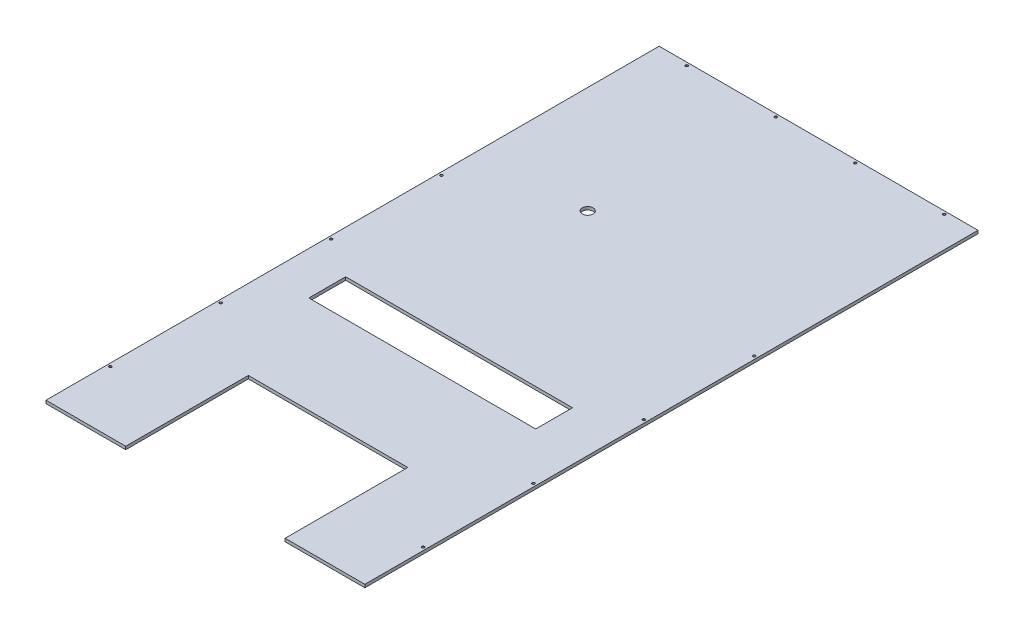
ISO-10303-21;
HEADER;
FILE_DESCRIPTION(('STEP AP214'),'2;1');
FILE_NAME('part.step','',(''),(''),'','','');
FILE_SCHEMA(('AUTOMOTIVE_DESIGN { 1 0 10303 214 1 1 1 1 }'));
ENDSEC;
DATA;
#1=APPLICATION_CONTEXT('core data for automotive mechanical design processes');
#2=APPLICATION_PROTOCOL_DEFINITION('international standard','automotive_design',2000,#1);
#3=PRODUCT_CONTEXT('',#1,'mechanical');
#4=PRODUCT('Part','Part','',(#3));
#5=PRODUCT_RELATED_PRODUCT_CATEGORY('part','',(#4));
#6=PRODUCT_DEFINITION_FORMATION('','',#4);
#7=PRODUCT_DEFINITION_CONTEXT('part definition',#1,'design');
#8=PRODUCT_DEFINITION('design','',#6,#7);
#9=PRODUCT_DEFINITION_SHAPE('','',#8);
#10=(LENGTH_UNIT() NAMED_UNIT(*) SI_UNIT(.MILLI.,.METRE.));
#11=(NAMED_UNIT(*) PLANE_ANGLE_UNIT() SI_UNIT($,.RADIAN.));
#12=(NAMED_UNIT(*) SI_UNIT($,.STERADIAN.) SOLID_ANGLE_UNIT());
#13=UNCERTAINTY_MEASURE_WITH_UNIT(LENGTH_MEASURE(1.E-05),#10,'distance_accuracy_value','');
#14=(GEOMETRIC_REPRESENTATION_CONTEXT(3) GLOBAL_UNCERTAINTY_ASSIGNED_CONTEXT((#13)) GLOBAL_UNIT_ASSIGNED_CONTEXT((#10,
#11,#12)) REPRESENTATION_CONTEXT('',''));
#15=CARTESIAN_POINT('',(0.,0.,0.));
#16=DIRECTION('',(0.,0.,1.));
#17=DIRECTION('',(1.,0.,0.));
#18=AXIS2_PLACEMENT_3D('',#15,#16,#17);
#19=CARTESIAN_POINT('',(0.,0.,2540.));
#20=DIRECTION('',(0.,1.,0.));
#21=DIRECTION('',(0.,0.,1.));
#22=AXIS2_PLACEMENT_3D('',#19,#20,#21);
#23=PLANE('',#22);
#24=CARTESIAN_POINT('',(442.977848989642,0.,738.973935122104));
#25=DIRECTION('',(0.,1.,0.));
#26=DIRECTION('',(0.,0.,1.));
#27=AXIS2_PLACEMENT_3D('',#24,#25,#26);
#28=CIRCLE('',#27,22.225);
#29=CARTESIAN_POINT('',(442.977848989642,0.,761.198935122104));
#30=VERTEX_POINT('',#29);
#31=EDGE_CURVE('E150',#30,#30,#28,.T.);
#32=ORIENTED_EDGE('',*,*,#31,.T.);
#33=EDGE_LOOP('',(#32));
#34=FACE_BOUND('',#33,.T.);
#35=DIRECTION('',(-1.,0.,0.));
#36=VECTOR('',#35,1.);
#37=CARTESIAN_POINT('',(177.8,0.,1476.502));
#38=LINE('',#37,#36);
#39=CARTESIAN_POINT('',(1117.6,0.,1476.502));
#40=VERTEX_POINT('',#39);
#41=CARTESIAN_POINT('',(177.8,0.,1476.502));
#42=VERTEX_POINT('',#41);
#43=EDGE_CURVE('E141',#40,#42,#38,.T.);
#44=ORIENTED_EDGE('',*,*,#43,.T.);
#45=DIRECTION('',(0.,0.,1.));
#46=VECTOR('',#45,1.);
#47=CARTESIAN_POINT('',(177.8,0.,1628.902));
#48=LINE('',#47,#46);
#49=CARTESIAN_POINT('',(177.8,0.,1628.902));
#50=VERTEX_POINT('',#49);
#51=EDGE_CURVE('E137',#42,#50,#48,.T.);
#52=ORIENTED_EDGE('',*,*,#51,.T.);
#53=DIRECTION('',(1.,0.,0.));
#54=VECTOR('',#53,1.);
#55=CARTESIAN_POINT('',(177.8,0.,1628.902));
#56=LINE('',#55,#54);
#57=CARTESIAN_POINT('',(1117.6,0.,1628.902));
#58=VERTEX_POINT('',#57);
#59=EDGE_CURVE('E144',#50,#58,#56,.T.);
#60=ORIENTED_EDGE('',*,*,#59,.T.);
#61=DIRECTION('',(0.,0.,-1.));
#62=VECTOR('',#61,1.);
#63=CARTESIAN_POINT('',(1117.6,0.,1628.902));
#64=LINE('',#63,#62);
#65=EDGE_CURVE('E60',#58,#40,#64,.T.);
#66=ORIENTED_EDGE('',*,*,#65,.T.);
#67=EDGE_LOOP('',(#44,#52,#60,#66));
#68=FACE_BOUND('',#67,.T.);
#69=CARTESIAN_POINT('',(1308.1,0.,2286.));
#70=DIRECTION('',(0.,1.,0.));
#71=DIRECTION('',(0.,0.,1.));
#72=AXIS2_PLACEMENT_3D('',#69,#70,#71);
#73=CIRCLE('',#72,4.7625);
#74=CARTESIAN_POINT('',(1308.1,0.,2290.7625));
#75=VERTEX_POINT('',#74);
#76=EDGE_CURVE('E171',#75,#75,#73,.T.);
#77=ORIENTED_EDGE('',*,*,#76,.T.);
#78=EDGE_LOOP('',(#77));
#79=FACE_BOUND('',#78,.T.);
#80=CARTESIAN_POINT('',(1308.1,0.,1828.8));
#81=DIRECTION('',(0.,1.,0.));
#82=DIRECTION('',(0.,0.,1.));
#83=AXIS2_PLACEMENT_3D('',#80,#81,#82);
#84=CIRCLE('',#83,4.7625);
#85=CARTESIAN_POINT('',(1308.1,0.,1833.5625));
#86=VERTEX_POINT('',#85);
#87=EDGE_CURVE('E180',#86,#86,#84,.T.);
#88=ORIENTED_EDGE('',*,*,#87,.T.);
#89=EDGE_LOOP('',(#88));
#90=FACE_BOUND('',#89,.T.);
#91=CARTESIAN_POINT('',(1308.1,0.,1371.6));
#92=DIRECTION('',(0.,1.,0.));
#93=DIRECTION('',(0.,0.,1.));
#94=AXIS2_PLACEMENT_3D('',#91,#92,#93);
#95=CIRCLE('',#94,4.7625);
#96=CARTESIAN_POINT('',(1308.1,0.,1376.3625));
#97=VERTEX_POINT('',#96);
#98=EDGE_CURVE('E189',#97,#97,#95,.T.);
#99=ORIENTED_EDGE('',*,*,#98,.T.);
#100=EDGE_LOOP('',(#99));
#101=FACE_BOUND('',#100,.T.);
#102=CARTESIAN_POINT('',(1308.1,0.,914.4));
#103=DIRECTION('',(0.,1.,0.));
#104=DIRECTION('',(0.,0.,1.));
#105=AXIS2_PLACEMENT_3D('',#102,#103,#104);
#106=CIRCLE('',#105,4.7625);
#107=CARTESIAN_POINT('',(1308.1,0.,919.1625));
#108=VERTEX_POINT('',#107);
#109=EDGE_CURVE('E198',#108,#108,#106,.T.);
#110=ORIENTED_EDGE('',*,*,#109,.T.);
#111=EDGE_LOOP('',(#110));
#112=FACE_BOUND('',#111,.T.);
#113=CARTESIAN_POINT('',(12.7000000000006,0.,2286.));
#114=DIRECTION('',(0.,1.,0.));
#115=DIRECTION('',(0.,0.,1.));
#116=AXIS2_PLACEMENT_3D('',#113,#114,#115);
#117=CIRCLE('',#116,4.7625);
#118=CARTESIAN_POINT('',(12.7000000000006,0.,2290.7625));
#119=VERTEX_POINT('',#118);
#120=EDGE_CURVE('E207',#119,#119,#117,.T.);
#121=ORIENTED_EDGE('',*,*,#120,.T.);
#122=EDGE_LOOP('',(#121));
#123=FACE_BOUND('',#122,.T.);
#124=CARTESIAN_POINT('',(12.7000000000004,0.,1828.8));
#125=DIRECTION('',(0.,1.,0.));
#126=DIRECTION('',(0.,0.,1.));
#127=AXIS2_PLACEMENT_3D('',#124,#125,#126);
#128=CIRCLE('',#127,4.7625);
#129=CARTESIAN_POINT('',(12.7000000000004,0.,1833.5625));
#130=VERTEX_POINT('',#129);
#131=EDGE_CURVE('E216',#130,#130,#128,.T.);
#132=ORIENTED_EDGE('',*,*,#131,.T.);
#133=EDGE_LOOP('',(#132));
#134=FACE_BOUND('',#133,.T.);
#135=CARTESIAN_POINT('',(12.7000000000004,0.,1371.6));
#136=DIRECTION('',(0.,1.,0.));
#137=DIRECTION('',(0.,0.,1.));
#138=AXIS2_PLACEMENT_3D('',#135,#136,#137);
#139=CIRCLE('',#138,4.7625);
#140=CARTESIAN_POINT('',(12.7000000000004,0.,1376.3625));
#141=VERTEX_POINT('',#140);
#142=EDGE_CURVE('E225',#141,#141,#139,.T.);
#143=ORIENTED_EDGE('',*,*,#142,.T.);
#144=EDGE_LOOP('',(#143));
#145=FACE_BOUND('',#144,.T.);
#146=CARTESIAN_POINT('',(12.7000000000002,0.,914.4));
#147=DIRECTION('',(0.,1.,0.));
#148=DIRECTION('',(0.,0.,1.));
#149=AXIS2_PLACEMENT_3D('',#146,#147,#148);
#150=CIRCLE('',#149,4.7625);
#151=CARTESIAN_POINT('',(12.7000000000002,0.,919.1625));
#152=VERTEX_POINT('',#151);
#153=EDGE_CURVE('E234',#152,#152,#150,.T.);
#154=ORIENTED_EDGE('',*,*,#153,.T.);
#155=EDGE_LOOP('',(#154));
#156=FACE_BOUND('',#155,.T.);
#157=CARTESIAN_POINT('',(495.3,0.,12.7000000000002));
#158=DIRECTION('',(0.,1.,0.));
#159=DIRECTION('',(0.,0.,1.));
#160=AXIS2_PLACEMENT_3D('',#157,#158,#159);
#161=CIRCLE('',#160,4.7625);
#162=CARTESIAN_POINT('',(495.3,0.,17.4625000000002));
#163=VERTEX_POINT('',#162);
#164=EDGE_CURVE('E243',#163,#163,#161,.T.);
#165=ORIENTED_EDGE('',*,*,#164,.T.);
#166=EDGE_LOOP('',(#165));
#167=FACE_BOUND('',#166,.T.);
#168=CARTESIAN_POINT('',(127.,0.,12.7000000000002));
#169=DIRECTION('',(0.,1.,0.));
#170=DIRECTION('',(0.,0.,1.));
#171=AXIS2_PLACEMENT_3D('',#168,#169,#170);
#172=CIRCLE('',#171,4.7625);
#173=CARTESIAN_POINT('',(127.,0.,17.4625000000002));
#174=VERTEX_POINT('',#173);
#175=EDGE_CURVE('E252',#174,#174,#172,.T.);
#176=ORIENTED_EDGE('',*,*,#175,.T.);
#177=EDGE_LOOP('',(#176));
#178=FACE_BOUND('',#177,.T.);
#179=CARTESIAN_POINT('',(1193.8,0.,12.7000000000001));
#180=DIRECTION('',(0.,1.,0.));
#181=DIRECTION('',(0.,0.,1.));
#182=AXIS2_PLACEMENT_3D('',#179,#180,#181);
#183=CIRCLE('',#182,4.7625);
#184=CARTESIAN_POINT('',(1193.8,0.,17.4625000000001));
#185=VERTEX_POINT('',#184);
#186=EDGE_CURVE('E261',#185,#185,#183,.T.);
#187=ORIENTED_EDGE('',*,*,#186,.T.);
#188=EDGE_LOOP('',(#187));
#189=FACE_BOUND('',#188,.T.);
#190=CARTESIAN_POINT('',(825.5,0.,12.7000000000002));
#191=DIRECTION('',(0.,1.,0.));
#192=DIRECTION('',(0.,0.,1.));
#193=AXIS2_PLACEMENT_3D('',#190,#191,#192);
#194=CIRCLE('',#193,4.7625);
#195=CARTESIAN_POINT('',(825.5,0.,17.4625000000002));
#196=VERTEX_POINT('',#195);
#197=EDGE_CURVE('E270',#196,#196,#194,.T.);
#198=ORIENTED_EDGE('',*,*,#197,.T.);
#199=EDGE_LOOP('',(#198));
#200=FACE_BOUND('',#199,.T.);
#201=DIRECTION('',(0.,0.,-1.));
#202=VECTOR('',#201,1.);
#203=CARTESIAN_POINT('',(330.2,0.,2540.));
#204=LINE('',#203,#202);
#205=CARTESIAN_POINT('',(330.2,0.,2540.));
#206=VERTEX_POINT('',#205);
#207=CARTESIAN_POINT('',(330.2,0.,2032.));
#208=VERTEX_POINT('',#207);
#209=EDGE_CURVE('E274',#206,#208,#204,.T.);
#210=ORIENTED_EDGE('',*,*,#209,.F.);
#211=DIRECTION('',(1.,0.,0.));
#212=VECTOR('',#211,1.);
#213=CARTESIAN_POINT('',(0.,0.,2540.));
#214=LINE('',#213,#212);
#215=CARTESIAN_POINT('',(0.,0.,2540.));
#216=VERTEX_POINT('',#215);
#217=EDGE_CURVE('E304',#216,#206,#214,.T.);
#218=ORIENTED_EDGE('',*,*,#217,.F.);
#219=DIRECTION('',(0.,0.,-1.));
#220=VECTOR('',#219,1.);
#221=CARTESIAN_POINT('',(0.,0.,2540.));
#222=LINE('',#221,#220);
#223=CARTESIAN_POINT('',(0.,0.,0.));
#224=VERTEX_POINT('',#223);
#225=EDGE_CURVE('E329',#216,#224,#222,.T.);
#226=ORIENTED_EDGE('',*,*,#225,.T.);
#227=DIRECTION('',(1.,0.,0.));
#228=VECTOR('',#227,1.);
#229=CARTESIAN_POINT('',(0.,0.,0.));
#230=LINE('',#229,#228);
#231=CARTESIAN_POINT('',(1320.8,0.,0.));
#232=VERTEX_POINT('',#231);
#233=EDGE_CURVE('E316',#224,#232,#230,.T.);
#234=ORIENTED_EDGE('',*,*,#233,.T.);
#235=DIRECTION('',(0.,0.,-1.));
#236=VECTOR('',#235,1.);
#237=CARTESIAN_POINT('',(1320.8,0.,2540.));
#238=LINE('',#237,#236);
#239=CARTESIAN_POINT('',(1320.8,0.,2540.));
#240=VERTEX_POINT('',#239);
#241=EDGE_CURVE('E326',#240,#232,#238,.T.);
#242=ORIENTED_EDGE('',*,*,#241,.F.);
#243=CARTESIAN_POINT('',(990.6,0.,2540.));
#244=VERTEX_POINT('',#243);
#245=EDGE_CURVE('E302',#244,#240,#214,.T.);
#246=ORIENTED_EDGE('',*,*,#245,.F.);
#247=DIRECTION('',(0.,0.,1.));
#248=VECTOR('',#247,1.);
#249=CARTESIAN_POINT('',(990.6,0.,2032.));
#250=LINE('',#249,#248);
#251=CARTESIAN_POINT('',(990.6,0.,2032.));
#252=VERTEX_POINT('',#251);
#253=EDGE_CURVE('E279',#252,#244,#250,.T.);
#254=ORIENTED_EDGE('',*,*,#253,.F.);
#255=DIRECTION('',(1.,0.,0.));
#256=VECTOR('',#255,1.);
#257=CARTESIAN_POINT('',(330.2,0.,2032.));
#258=LINE('',#257,#256);
#259=EDGE_CURVE('E276',#208,#252,#258,.T.);
#260=ORIENTED_EDGE('',*,*,#259,.F.);
#261=EDGE_LOOP('',(#210,#218,#226,#234,#242,#246,#254,#260));
#262=FACE_BOUND('',#261,.T.);
#263=ADVANCED_FACE('F45',(#34,#68,#79,#90,#101,#112,#123,#134,#145,#156,#167,#178,#189,#200,
#262),#23,.F.);
#264=CARTESIAN_POINT('',(0.,12.7,2540.));
#265=DIRECTION('',(0.,-1.,0.));
#266=DIRECTION('',(0.,0.,-1.));
#267=AXIS2_PLACEMENT_3D('',#264,#265,#266);
#268=PLANE('',#267);
#269=CARTESIAN_POINT('',(442.977848989642,12.7,738.973935122104));
#270=DIRECTION('',(0.,1.,0.));
#271=DIRECTION('',(0.,0.,1.));
#272=AXIS2_PLACEMENT_3D('',#269,#270,#271);
#273=CIRCLE('',#272,22.225);
#274=CARTESIAN_POINT('',(442.977848989642,12.7,761.198935122104));
#275=VERTEX_POINT('',#274);
#276=EDGE_CURVE('E153',#275,#275,#273,.T.);
#277=ORIENTED_EDGE('',*,*,#276,.F.);
#278=EDGE_LOOP('',(#277));
#279=FACE_BOUND('',#278,.T.);
#280=DIRECTION('',(-1.,0.,0.));
#281=VECTOR('',#280,1.);
#282=CARTESIAN_POINT('',(0.,12.7,1628.902));
#283=LINE('',#282,#281);
#284=CARTESIAN_POINT('',(1117.6,12.7,1628.902));
#285=VERTEX_POINT('',#284);
#286=CARTESIAN_POINT('',(177.8,12.7,1628.902));
#287=VERTEX_POINT('',#286);
#288=EDGE_CURVE('E332',#285,#287,#283,.T.);
#289=ORIENTED_EDGE('',*,*,#288,.T.);
#290=DIRECTION('',(0.,0.,-1.));
#291=VECTOR('',#290,1.);
#292=CARTESIAN_POINT('',(177.8,12.7,2540.));
#293=LINE('',#292,#291);
#294=CARTESIAN_POINT('',(177.8,12.7,1476.502));
#295=VERTEX_POINT('',#294);
#296=EDGE_CURVE('E11',#287,#295,#293,.T.);
#297=ORIENTED_EDGE('',*,*,#296,.T.);
#298=DIRECTION('',(1.,0.,0.));
#299=VECTOR('',#298,1.);
#300=CARTESIAN_POINT('',(0.,12.7,1476.502));
#301=LINE('',#300,#299);
#302=CARTESIAN_POINT('',(1117.6,12.7,1476.502));
#303=VERTEX_POINT('',#302);
#304=EDGE_CURVE('E53',#295,#303,#301,.T.);
#305=ORIENTED_EDGE('',*,*,#304,.T.);
#306=DIRECTION('',(0.,0.,1.));
#307=VECTOR('',#306,1.);
#308=CARTESIAN_POINT('',(1117.6,12.7,2540.));
#309=LINE('',#308,#307);
#310=EDGE_CURVE('E334',#303,#285,#309,.T.);
#311=ORIENTED_EDGE('',*,*,#310,.T.);
#312=EDGE_LOOP('',(#289,#297,#305,#311));
#313=FACE_BOUND('',#312,.T.);
#314=CARTESIAN_POINT('',(1308.1,12.7,2286.));
#315=DIRECTION('',(0.,1.,0.));
#316=DIRECTION('',(0.,0.,1.));
#317=AXIS2_PLACEMENT_3D('',#314,#315,#316);
#318=CIRCLE('',#317,5.39749999999994);
#319=CARTESIAN_POINT('',(1308.1,12.7,2291.3975));
#320=VERTEX_POINT('',#319);
#321=EDGE_CURVE('E161',#320,#320,#318,.T.);
#322=ORIENTED_EDGE('',*,*,#321,.F.);
#323=EDGE_LOOP('',(#322));
#324=FACE_BOUND('',#323,.T.);
#325=CARTESIAN_POINT('',(1308.1,12.7,1828.8));
#326=DIRECTION('',(0.,1.,0.));
#327=DIRECTION('',(0.,0.,1.));
#328=AXIS2_PLACEMENT_3D('',#325,#326,#327);
#329=CIRCLE('',#328,5.39749999999994);
#330=CARTESIAN_POINT('',(1308.1,12.7,1834.1975));
#331=VERTEX_POINT('',#330);
#332=EDGE_CURVE('E174',#331,#331,#329,.T.);
#333=ORIENTED_EDGE('',*,*,#332,.F.);
#334=EDGE_LOOP('',(#333));
#335=FACE_BOUND('',#334,.T.);
#336=CARTESIAN_POINT('',(1308.1,12.7,1371.6));
#337=DIRECTION('',(0.,1.,0.));
#338=DIRECTION('',(0.,0.,1.));
#339=AXIS2_PLACEMENT_3D('',#336,#337,#338);
#340=CIRCLE('',#339,5.39749999999994);
#341=CARTESIAN_POINT('',(1308.1,12.7,1376.9975));
#342=VERTEX_POINT('',#341);
#343=EDGE_CURVE('E183',#342,#342,#340,.T.);
#344=ORIENTED_EDGE('',*,*,#343,.F.);
#345=EDGE_LOOP('',(#344));
#346=FACE_BOUND('',#345,.T.);
#347=CARTESIAN_POINT('',(1308.1,12.7,914.4));
#348=DIRECTION('',(0.,1.,0.));
#349=DIRECTION('',(0.,0.,1.));
#350=AXIS2_PLACEMENT_3D('',#347,#348,#349);
#351=CIRCLE('',#350,5.39749999999994);
#352=CARTESIAN_POINT('',(1308.1,12.7,919.7975));
#353=VERTEX_POINT('',#352);
#354=EDGE_CURVE('E192',#353,#353,#351,.T.);
#355=ORIENTED_EDGE('',*,*,#354,.F.);
#356=EDGE_LOOP('',(#355));
#357=FACE_BOUND('',#356,.T.);
#358=CARTESIAN_POINT('',(12.7000000000006,12.7,2286.));
#359=DIRECTION('',(0.,1.,0.));
#360=DIRECTION('',(0.,0.,1.));
#361=AXIS2_PLACEMENT_3D('',#358,#359,#360);
#362=CIRCLE('',#361,5.3975);
#363=CARTESIAN_POINT('',(12.7000000000006,12.7,2291.3975));
#364=VERTEX_POINT('',#363);
#365=EDGE_CURVE('E201',#364,#364,#362,.T.);
#366=ORIENTED_EDGE('',*,*,#365,.F.);
#367=EDGE_LOOP('',(#366));
#368=FACE_BOUND('',#367,.T.);
#369=CARTESIAN_POINT('',(12.7000000000004,12.7,1828.8));
#370=DIRECTION('',(0.,1.,0.));
#371=DIRECTION('',(0.,0.,1.));
#372=AXIS2_PLACEMENT_3D('',#369,#370,#371);
#373=CIRCLE('',#372,5.3975);
#374=CARTESIAN_POINT('',(12.7000000000004,12.7,1834.1975));
#375=VERTEX_POINT('',#374);
#376=EDGE_CURVE('E210',#375,#375,#373,.T.);
#377=ORIENTED_EDGE('',*,*,#376,.F.);
#378=EDGE_LOOP('',(#377));
#379=FACE_BOUND('',#378,.T.);
#380=CARTESIAN_POINT('',(12.7000000000004,12.7,1371.6));
#381=DIRECTION('',(0.,1.,0.));
#382=DIRECTION('',(0.,0.,1.));
#383=AXIS2_PLACEMENT_3D('',#380,#381,#382);
#384=CIRCLE('',#383,5.3975);
#385=CARTESIAN_POINT('',(12.7000000000004,12.7,1376.9975));
#386=VERTEX_POINT('',#385);
#387=EDGE_CURVE('E219',#386,#386,#384,.T.);
#388=ORIENTED_EDGE('',*,*,#387,.F.);
#389=EDGE_LOOP('',(#388));
#390=FACE_BOUND('',#389,.T.);
#391=CARTESIAN_POINT('',(12.7000000000002,12.7,914.4));
#392=DIRECTION('',(0.,1.,0.));
#393=DIRECTION('',(0.,0.,1.));
#394=AXIS2_PLACEMENT_3D('',#391,#392,#393);
#395=CIRCLE('',#394,5.3975);
#396=CARTESIAN_POINT('',(12.7000000000002,12.7,919.7975));
#397=VERTEX_POINT('',#396);
#398=EDGE_CURVE('E228',#397,#397,#395,.T.);
#399=ORIENTED_EDGE('',*,*,#398,.F.);
#400=EDGE_LOOP('',(#399));
#401=FACE_BOUND('',#400,.T.);
#402=CARTESIAN_POINT('',(495.3,12.7,12.7000000000002));
#403=DIRECTION('',(0.,1.,0.));
#404=DIRECTION('',(0.,0.,1.));
#405=AXIS2_PLACEMENT_3D('',#402,#403,#404);
#406=CIRCLE('',#405,5.39750000000006);
#407=CARTESIAN_POINT('',(495.3,12.7,18.0975000000003));
#408=VERTEX_POINT('',#407);
#409=EDGE_CURVE('E237',#408,#408,#406,.T.);
#410=ORIENTED_EDGE('',*,*,#409,.F.);
#411=EDGE_LOOP('',(#410));
#412=FACE_BOUND('',#411,.T.);
#413=CARTESIAN_POINT('',(127.,12.7,12.7000000000002));
#414=DIRECTION('',(0.,1.,0.));
#415=DIRECTION('',(0.,0.,1.));
#416=AXIS2_PLACEMENT_3D('',#413,#414,#415);
#417=CIRCLE('',#416,5.3975);
#418=CARTESIAN_POINT('',(127.,12.7,18.0975000000002));
#419=VERTEX_POINT('',#418);
#420=EDGE_CURVE('E246',#419,#419,#417,.T.);
#421=ORIENTED_EDGE('',*,*,#420,.F.);
#422=EDGE_LOOP('',(#421));
#423=FACE_BOUND('',#422,.T.);
#424=CARTESIAN_POINT('',(1193.8,12.7,12.7000000000001));
#425=DIRECTION('',(0.,1.,0.));
#426=DIRECTION('',(0.,0.,1.));
#427=AXIS2_PLACEMENT_3D('',#424,#425,#426);
#428=CIRCLE('',#427,5.39749999999994);
#429=CARTESIAN_POINT('',(1193.8,12.7,18.0975));
#430=VERTEX_POINT('',#429);
#431=EDGE_CURVE('E255',#430,#430,#428,.T.);
#432=ORIENTED_EDGE('',*,*,#431,.F.);
#433=EDGE_LOOP('',(#432));
#434=FACE_BOUND('',#433,.T.);
#435=CARTESIAN_POINT('',(825.5,12.7,12.7000000000002));
#436=DIRECTION('',(0.,1.,0.));
#437=DIRECTION('',(0.,0.,1.));
#438=AXIS2_PLACEMENT_3D('',#435,#436,#437);
#439=CIRCLE('',#438,5.39750000000006);
#440=CARTESIAN_POINT('',(825.5,12.7,18.0975000000002));
#441=VERTEX_POINT('',#440);
#442=EDGE_CURVE('E264',#441,#441,#439,.T.);
#443=ORIENTED_EDGE('',*,*,#442,.F.);
#444=EDGE_LOOP('',(#443));
#445=FACE_BOUND('',#444,.T.);
#446=DIRECTION('',(0.,0.,-1.));
#447=VECTOR('',#446,1.);
#448=CARTESIAN_POINT('',(330.2,12.7,2540.));
#449=LINE('',#448,#447);
#450=CARTESIAN_POINT('',(330.2,12.7,2540.));
#451=VERTEX_POINT('',#450);
#452=CARTESIAN_POINT('',(330.2,12.7,2032.));
#453=VERTEX_POINT('',#452);
#454=EDGE_CURVE('E273',#451,#453,#449,.T.);
#455=ORIENTED_EDGE('',*,*,#454,.T.);
#456=DIRECTION('',(1.,0.,0.));
#457=VECTOR('',#456,1.);
#458=CARTESIAN_POINT('',(330.2,12.7,2032.));
#459=LINE('',#458,#457);
#460=CARTESIAN_POINT('',(990.6,12.7,2032.));
#461=VERTEX_POINT('',#460);
#462=EDGE_CURVE('E284',#453,#461,#459,.T.);
#463=ORIENTED_EDGE('',*,*,#462,.T.);
#464=DIRECTION('',(0.,0.,1.));
#465=VECTOR('',#464,1.);
#466=CARTESIAN_POINT('',(990.6,12.7,2032.));
#467=LINE('',#466,#465);
#468=CARTESIAN_POINT('',(990.6,12.7,2540.));
#469=VERTEX_POINT('',#468);
#470=EDGE_CURVE('E277',#461,#469,#467,.T.);
#471=ORIENTED_EDGE('',*,*,#470,.T.);
#472=DIRECTION('',(-1.,0.,0.));
#473=VECTOR('',#472,1.);
#474=CARTESIAN_POINT('',(0.,12.7,2540.));
#475=LINE('',#474,#473);
#476=CARTESIAN_POINT('',(1320.8,12.7,2540.));
#477=VERTEX_POINT('',#476);
#478=EDGE_CURVE('E310',#477,#469,#475,.T.);
#479=ORIENTED_EDGE('',*,*,#478,.F.);
#480=DIRECTION('',(0.,0.,-1.));
#481=VECTOR('',#480,1.);
#482=CARTESIAN_POINT('',(1320.8,12.7,2540.));
#483=LINE('',#482,#481);
#484=CARTESIAN_POINT('',(1320.8,12.7,0.));
#485=VERTEX_POINT('',#484);
#486=EDGE_CURVE('E323',#477,#485,#483,.T.);
#487=ORIENTED_EDGE('',*,*,#486,.T.);
#488=DIRECTION('',(-1.,0.,0.));
#489=VECTOR('',#488,1.);
#490=CARTESIAN_POINT('',(0.,12.7,0.));
#491=LINE('',#490,#489);
#492=CARTESIAN_POINT('',(0.,12.7,0.));
#493=VERTEX_POINT('',#492);
#494=EDGE_CURVE('E303',#485,#493,#491,.T.);
#495=ORIENTED_EDGE('',*,*,#494,.T.);
#496=DIRECTION('',(0.,0.,-1.));
#497=VECTOR('',#496,1.);
#498=CARTESIAN_POINT('',(0.,12.7,2540.));
#499=LINE('',#498,#497);
#500=CARTESIAN_POINT('',(0.,12.7,2540.));
#501=VERTEX_POINT('',#500);
#502=EDGE_CURVE('E313',#501,#493,#499,.T.);
#503=ORIENTED_EDGE('',*,*,#502,.F.);
#504=EDGE_CURVE('E309',#451,#501,#475,.T.);
#505=ORIENTED_EDGE('',*,*,#504,.F.);
#506=EDGE_LOOP('',(#455,#463,#471,#479,#487,#495,#503,#505));
#507=FACE_BOUND('',#506,.T.);
#508=ADVANCED_FACE('F338',(#279,#313,#324,#335,#346,#357,#368,#379,#390,#401,#412,#423,#434,
#445,#507),#268,.F.);
#509=CARTESIAN_POINT('',(0.,0.,2540.));
#510=DIRECTION('',(0.,0.,-1.));
#511=DIRECTION('',(-1.,0.,0.));
#512=AXIS2_PLACEMENT_3D('',#509,#510,#511);
#513=PLANE('',#512);
#514=DIRECTION('',(0.,1.,0.));
#515=VECTOR('',#514,1.);
#516=CARTESIAN_POINT('',(330.2,0.,2540.));
#517=LINE('',#516,#515);
#518=EDGE_CURVE('E281',#206,#451,#517,.T.);
#519=ORIENTED_EDGE('',*,*,#518,.T.);
#520=ORIENTED_EDGE('',*,*,#504,.T.);
#521=DIRECTION('',(0.,-1.,0.));
#522=VECTOR('',#521,1.);
#523=CARTESIAN_POINT('',(0.,0.,2540.));
#524=LINE('',#523,#522);
#525=EDGE_CURVE('E299',#501,#216,#524,.T.);
#526=ORIENTED_EDGE('',*,*,#525,.T.);
#527=ORIENTED_EDGE('',*,*,#217,.T.);
#528=EDGE_LOOP('',(#519,#520,#526,#527));
#529=FACE_BOUND('',#528,.T.);
#530=ADVANCED_FACE('F359',(#529),#513,.F.);
#531=DIRECTION('',(0.,1.,0.));
#532=VECTOR('',#531,1.);
#533=CARTESIAN_POINT('',(990.6,0.,2540.));
#534=LINE('',#533,#532);
#535=EDGE_CURVE('E291',#244,#469,#534,.T.);
#536=ORIENTED_EDGE('',*,*,#535,.F.);
#537=ORIENTED_EDGE('',*,*,#245,.T.);
#538=DIRECTION('',(0.,1.,0.));
#539=VECTOR('',#538,1.);
#540=CARTESIAN_POINT('',(1320.8,0.,2540.));
#541=LINE('',#540,#539);
#542=EDGE_CURVE('E307',#240,#477,#541,.T.);
#543=ORIENTED_EDGE('',*,*,#542,.T.);
#544=ORIENTED_EDGE('',*,*,#478,.T.);
#545=EDGE_LOOP('',(#536,#537,#543,#544));
#546=FACE_BOUND('',#545,.T.);
#547=ADVANCED_FACE('F374',(#546),#513,.F.);
#548=CARTESIAN_POINT('',(0.,0.,2540.));
#549=DIRECTION('',(1.,0.,0.));
#550=DIRECTION('',(0.,0.,-1.));
#551=AXIS2_PLACEMENT_3D('',#548,#549,#550);
#552=PLANE('',#551);
#553=DIRECTION('',(0.,-1.,0.));
#554=VECTOR('',#553,1.);
#555=CARTESIAN_POINT('',(0.,0.,0.));
#556=LINE('',#555,#554);
#557=EDGE_CURVE('E298',#493,#224,#556,.T.);
#558=ORIENTED_EDGE('',*,*,#557,.T.);
#559=ORIENTED_EDGE('',*,*,#225,.F.);
#560=ORIENTED_EDGE('',*,*,#525,.F.);
#561=ORIENTED_EDGE('',*,*,#502,.T.);
#562=EDGE_LOOP('',(#558,#559,#560,#561));
#563=FACE_BOUND('',#562,.T.);
#564=ADVANCED_FACE('F47',(#563),#552,.F.);
#565=CARTESIAN_POINT('',(1320.8,0.,2540.));
#566=DIRECTION('',(-1.,0.,0.));
#567=DIRECTION('',(0.,0.,1.));
#568=AXIS2_PLACEMENT_3D('',#565,#566,#567);
#569=PLANE('',#568);
#570=DIRECTION('',(0.,1.,0.));
#571=VECTOR('',#570,1.);
#572=CARTESIAN_POINT('',(1320.8,0.,0.));
#573=LINE('',#572,#571);
#574=EDGE_CURVE('E318',#232,#485,#573,.T.);
#575=ORIENTED_EDGE('',*,*,#574,.T.);
#576=ORIENTED_EDGE('',*,*,#486,.F.);
#577=ORIENTED_EDGE('',*,*,#542,.F.);
#578=ORIENTED_EDGE('',*,*,#241,.T.);
#579=EDGE_LOOP('',(#575,#576,#577,#578));
#580=FACE_BOUND('',#579,.T.);
#581=ADVANCED_FACE('F363',(#580),#569,.F.);
#582=CARTESIAN_POINT('',(0.,0.,0.));
#583=DIRECTION('',(0.,0.,-1.));
#584=DIRECTION('',(-1.,0.,0.));
#585=AXIS2_PLACEMENT_3D('',#582,#583,#584);
#586=PLANE('',#585);
#587=ORIENTED_EDGE('',*,*,#557,.F.);
#588=ORIENTED_EDGE('',*,*,#494,.F.);
#589=ORIENTED_EDGE('',*,*,#574,.F.);
#590=ORIENTED_EDGE('',*,*,#233,.F.);
#591=EDGE_LOOP('',(#587,#588,#589,#590));
#592=FACE_BOUND('',#591,.T.);
#593=ADVANCED_FACE('F365',(#592),#586,.T.);
#594=CARTESIAN_POINT('',(330.2,0.,2540.));
#595=DIRECTION('',(1.,0.,0.));
#596=DIRECTION('',(0.,0.,-1.));
#597=AXIS2_PLACEMENT_3D('',#594,#595,#596);
#598=PLANE('',#597);
#599=ORIENTED_EDGE('',*,*,#454,.F.);
#600=ORIENTED_EDGE('',*,*,#518,.F.);
#601=ORIENTED_EDGE('',*,*,#209,.T.);
#602=DIRECTION('',(0.,1.,0.));
#603=VECTOR('',#602,1.);
#604=CARTESIAN_POINT('',(330.2,0.,2032.));
#605=LINE('',#604,#603);
#606=EDGE_CURVE('E295',#208,#453,#605,.T.);
#607=ORIENTED_EDGE('',*,*,#606,.T.);
#608=EDGE_LOOP('',(#599,#600,#601,#607));
#609=FACE_BOUND('',#608,.T.);
#610=ADVANCED_FACE('F370',(#609),#598,.T.);
#611=CARTESIAN_POINT('',(330.2,0.,2032.));
#612=DIRECTION('',(0.,0.,1.));
#613=DIRECTION('',(1.,0.,0.));
#614=AXIS2_PLACEMENT_3D('',#611,#612,#613);
#615=PLANE('',#614);
#616=ORIENTED_EDGE('',*,*,#462,.F.);
#617=ORIENTED_EDGE('',*,*,#606,.F.);
#618=ORIENTED_EDGE('',*,*,#259,.T.);
#619=DIRECTION('',(0.,1.,0.));
#620=VECTOR('',#619,1.);
#621=CARTESIAN_POINT('',(990.6,0.,2032.));
#622=LINE('',#621,#620);
#623=EDGE_CURVE('E293',#252,#461,#622,.T.);
#624=ORIENTED_EDGE('',*,*,#623,.T.);
#625=EDGE_LOOP('',(#616,#617,#618,#624));
#626=FACE_BOUND('',#625,.T.);
#627=ADVANCED_FACE('F378',(#626),#615,.T.);
#628=CARTESIAN_POINT('',(990.6,0.,2032.));
#629=DIRECTION('',(-1.,0.,0.));
#630=DIRECTION('',(0.,0.,1.));
#631=AXIS2_PLACEMENT_3D('',#628,#629,#630);
#632=PLANE('',#631);
#633=ORIENTED_EDGE('',*,*,#470,.F.);
#634=ORIENTED_EDGE('',*,*,#623,.F.);
#635=ORIENTED_EDGE('',*,*,#253,.T.);
#636=ORIENTED_EDGE('',*,*,#535,.T.);
#637=EDGE_LOOP('',(#633,#634,#635,#636));
#638=FACE_BOUND('',#637,.T.);
#639=ADVANCED_FACE('F382',(#638),#632,.T.);
#640=CARTESIAN_POINT('',(825.5,12.7,12.7000000000002));
#641=DIRECTION('',(0.,1.,0.));
#642=DIRECTION('',(0.,0.,1.));
#643=AXIS2_PLACEMENT_3D('',#640,#641,#642);
#644=CYLINDRICAL_SURFACE('',#643,4.7625);
#645=ORIENTED_EDGE('',*,*,#197,.F.);
#646=EDGE_LOOP('',(#645));
#647=FACE_BOUND('',#646,.T.);
#648=CARTESIAN_POINT('',(825.5,12.065,12.7000000000002));
#649=DIRECTION('',(0.,1.,0.));
#650=DIRECTION('',(0.,0.,1.));
#651=AXIS2_PLACEMENT_3D('',#648,#649,#650);
#652=CIRCLE('',#651,4.7625);
#653=CARTESIAN_POINT('',(825.5,12.065,17.4625000000002));
#654=VERTEX_POINT('',#653);
#655=EDGE_CURVE('E267',#654,#654,#652,.T.);
#656=ORIENTED_EDGE('',*,*,#655,.T.);
#657=EDGE_LOOP('',(#656));
#658=FACE_BOUND('',#657,.T.);
#659=ADVANCED_FACE('F386',(#647,#658),#644,.F.);
#660=CARTESIAN_POINT('',(825.5,12.7,12.7000000000002));
#661=DIRECTION('',(0.,1.,0.));
#662=DIRECTION('',(0.,0.,1.));
#663=AXIS2_PLACEMENT_3D('',#660,#661,#662);
#664=CONICAL_SURFACE('',#663,5.39750000000006,0.785398163397488);
#665=ORIENTED_EDGE('',*,*,#655,.F.);
#666=EDGE_LOOP('',(#665));
#667=FACE_BOUND('',#666,.T.);
#668=ORIENTED_EDGE('',*,*,#442,.T.);
#669=EDGE_LOOP('',(#668));
#670=FACE_BOUND('',#669,.T.);
#671=ADVANCED_FACE('F390',(#667,#670),#664,.F.);
#672=CARTESIAN_POINT('',(1193.8,12.7,12.7000000000001));
#673=DIRECTION('',(0.,1.,0.));
#674=DIRECTION('',(0.,0.,1.));
#675=AXIS2_PLACEMENT_3D('',#672,#673,#674);
#676=CYLINDRICAL_SURFACE('',#675,4.7625);
#677=ORIENTED_EDGE('',*,*,#186,.F.);
#678=EDGE_LOOP('',(#677));
#679=FACE_BOUND('',#678,.T.);
#680=CARTESIAN_POINT('',(1193.8,12.065,12.7000000000001));
#681=DIRECTION('',(0.,1.,0.));
#682=DIRECTION('',(0.,0.,1.));
#683=AXIS2_PLACEMENT_3D('',#680,#681,#682);
#684=CIRCLE('',#683,4.7625);
#685=CARTESIAN_POINT('',(1193.8,12.065,17.4625000000001));
#686=VERTEX_POINT('',#685);
#687=EDGE_CURVE('E258',#686,#686,#684,.T.);
#688=ORIENTED_EDGE('',*,*,#687,.T.);
#689=EDGE_LOOP('',(#688));
#690=FACE_BOUND('',#689,.T.);
#691=ADVANCED_FACE('F394',(#679,#690),#676,.F.);
#692=CARTESIAN_POINT('',(1193.8,12.7,12.7000000000001));
#693=DIRECTION('',(0.,1.,0.));
#694=DIRECTION('',(0.,0.,1.));
#695=AXIS2_PLACEMENT_3D('',#692,#693,#694);
#696=CONICAL_SURFACE('',#695,5.39749999999994,0.785398163397401);
#697=ORIENTED_EDGE('',*,*,#687,.F.);
#698=EDGE_LOOP('',(#697));
#699=FACE_BOUND('',#698,.T.);
#700=ORIENTED_EDGE('',*,*,#431,.T.);
#701=EDGE_LOOP('',(#700));
#702=FACE_BOUND('',#701,.T.);
#703=ADVANCED_FACE('F398',(#699,#702),#696,.F.);
#704=CARTESIAN_POINT('',(127.,12.7,12.7000000000002));
#705=DIRECTION('',(0.,1.,0.));
#706=DIRECTION('',(0.,0.,1.));
#707=AXIS2_PLACEMENT_3D('',#704,#705,#706);
#708=CYLINDRICAL_SURFACE('',#707,4.7625);
#709=ORIENTED_EDGE('',*,*,#175,.F.);
#710=EDGE_LOOP('',(#709));
#711=FACE_BOUND('',#710,.T.);
#712=CARTESIAN_POINT('',(127.,12.065,12.7000000000002));
#713=DIRECTION('',(0.,1.,0.));
#714=DIRECTION('',(0.,0.,1.));
#715=AXIS2_PLACEMENT_3D('',#712,#713,#714);
#716=CIRCLE('',#715,4.7625);
#717=CARTESIAN_POINT('',(127.,12.065,17.4625000000002));
#718=VERTEX_POINT('',#717);
#719=EDGE_CURVE('E249',#718,#718,#716,.T.);
#720=ORIENTED_EDGE('',*,*,#719,.T.);
#721=EDGE_LOOP('',(#720));
#722=FACE_BOUND('',#721,.T.);
#723=ADVANCED_FACE('F402',(#711,#722),#708,.F.);
#724=CARTESIAN_POINT('',(127.,12.7,12.7000000000002));
#725=DIRECTION('',(0.,1.,0.));
#726=DIRECTION('',(0.,0.,1.));
#727=AXIS2_PLACEMENT_3D('',#724,#725,#726);
#728=CONICAL_SURFACE('',#727,5.3975,0.785398163397444);
#729=ORIENTED_EDGE('',*,*,#719,.F.);
#730=EDGE_LOOP('',(#729));
#731=FACE_BOUND('',#730,.T.);
#732=ORIENTED_EDGE('',*,*,#420,.T.);
#733=EDGE_LOOP('',(#732));
#734=FACE_BOUND('',#733,.T.);
#735=ADVANCED_FACE('F406',(#731,#734),#728,.F.);
#736=CARTESIAN_POINT('',(495.3,12.7,12.7000000000002));
#737=DIRECTION('',(0.,1.,0.));
#738=DIRECTION('',(0.,0.,1.));
#739=AXIS2_PLACEMENT_3D('',#736,#737,#738);
#740=CYLINDRICAL_SURFACE('',#739,4.7625);
#741=ORIENTED_EDGE('',*,*,#164,.F.);
#742=EDGE_LOOP('',(#741));
#743=FACE_BOUND('',#742,.T.);
#744=CARTESIAN_POINT('',(495.3,12.065,12.7000000000002));
#745=DIRECTION('',(0.,1.,0.));
#746=DIRECTION('',(0.,0.,1.));
#747=AXIS2_PLACEMENT_3D('',#744,#745,#746);
#748=CIRCLE('',#747,4.7625);
#749=CARTESIAN_POINT('',(495.3,12.065,17.4625000000002));
#750=VERTEX_POINT('',#749);
#751=EDGE_CURVE('E240',#750,#750,#748,.T.);
#752=ORIENTED_EDGE('',*,*,#751,.T.);
#753=EDGE_LOOP('',(#752));
#754=FACE_BOUND('',#753,.T.);
#755=ADVANCED_FACE('F410',(#743,#754),#740,.F.);
#756=CARTESIAN_POINT('',(495.3,12.7,12.7000000000002));
#757=DIRECTION('',(0.,1.,0.));
#758=DIRECTION('',(0.,0.,1.));
#759=AXIS2_PLACEMENT_3D('',#756,#757,#758);
#760=CONICAL_SURFACE('',#759,5.39750000000006,0.785398163397488);
#761=ORIENTED_EDGE('',*,*,#751,.F.);
#762=EDGE_LOOP('',(#761));
#763=FACE_BOUND('',#762,.T.);
#764=ORIENTED_EDGE('',*,*,#409,.T.);
#765=EDGE_LOOP('',(#764));
#766=FACE_BOUND('',#765,.T.);
#767=ADVANCED_FACE('F414',(#763,#766),#760,.F.);
#768=CARTESIAN_POINT('',(12.7000000000002,12.7,914.4));
#769=DIRECTION('',(0.,1.,0.));
#770=DIRECTION('',(0.,0.,1.));
#771=AXIS2_PLACEMENT_3D('',#768,#769,#770);
#772=CYLINDRICAL_SURFACE('',#771,4.7625);
#773=ORIENTED_EDGE('',*,*,#153,.F.);
#774=EDGE_LOOP('',(#773));
#775=FACE_BOUND('',#774,.T.);
#776=CARTESIAN_POINT('',(12.7000000000002,12.065,914.4));
#777=DIRECTION('',(0.,1.,0.));
#778=DIRECTION('',(0.,0.,1.));
#779=AXIS2_PLACEMENT_3D('',#776,#777,#778);
#780=CIRCLE('',#779,4.7625);
#781=CARTESIAN_POINT('',(12.7000000000002,12.065,919.1625));
#782=VERTEX_POINT('',#781);
#783=EDGE_CURVE('E231',#782,#782,#780,.T.);
#784=ORIENTED_EDGE('',*,*,#783,.T.);
#785=EDGE_LOOP('',(#784));
#786=FACE_BOUND('',#785,.T.);
#787=ADVANCED_FACE('F418',(#775,#786),#772,.F.);
#788=CARTESIAN_POINT('',(12.7000000000002,12.7,914.4));
#789=DIRECTION('',(0.,1.,0.));
#790=DIRECTION('',(0.,0.,1.));
#791=AXIS2_PLACEMENT_3D('',#788,#789,#790);
#792=CONICAL_SURFACE('',#791,5.3975,0.785398163397447);
#793=ORIENTED_EDGE('',*,*,#783,.F.);
#794=EDGE_LOOP('',(#793));
#795=FACE_BOUND('',#794,.T.);
#796=ORIENTED_EDGE('',*,*,#398,.T.);
#797=EDGE_LOOP('',(#796));
#798=FACE_BOUND('',#797,.T.);
#799=ADVANCED_FACE('F422',(#795,#798),#792,.F.);
#800=CARTESIAN_POINT('',(12.7000000000004,12.7,1371.6));
#801=DIRECTION('',(0.,1.,0.));
#802=DIRECTION('',(0.,0.,1.));
#803=AXIS2_PLACEMENT_3D('',#800,#801,#802);
#804=CYLINDRICAL_SURFACE('',#803,4.7625);
#805=ORIENTED_EDGE('',*,*,#142,.F.);
#806=EDGE_LOOP('',(#805));
#807=FACE_BOUND('',#806,.T.);
#808=CARTESIAN_POINT('',(12.7000000000004,12.065,1371.6));
#809=DIRECTION('',(0.,1.,0.));
#810=DIRECTION('',(0.,0.,1.));
#811=AXIS2_PLACEMENT_3D('',#808,#809,#810);
#812=CIRCLE('',#811,4.7625);
#813=CARTESIAN_POINT('',(12.7000000000004,12.065,1376.3625));
#814=VERTEX_POINT('',#813);
#815=EDGE_CURVE('E222',#814,#814,#812,.T.);
#816=ORIENTED_EDGE('',*,*,#815,.T.);
#817=EDGE_LOOP('',(#816));
#818=FACE_BOUND('',#817,.T.);
#819=ADVANCED_FACE('F426',(#807,#818),#804,.F.);
#820=CARTESIAN_POINT('',(12.7000000000004,12.7,1371.6));
#821=DIRECTION('',(0.,1.,0.));
#822=DIRECTION('',(0.,0.,1.));
#823=AXIS2_PLACEMENT_3D('',#820,#821,#822);
#824=CONICAL_SURFACE('',#823,5.3975,0.785398163397447);
#825=ORIENTED_EDGE('',*,*,#815,.F.);
#826=EDGE_LOOP('',(#825));
#827=FACE_BOUND('',#826,.T.);
#828=ORIENTED_EDGE('',*,*,#387,.T.);
#829=EDGE_LOOP('',(#828));
#830=FACE_BOUND('',#829,.T.);
#831=ADVANCED_FACE('F430',(#827,#830),#824,.F.);
#832=CARTESIAN_POINT('',(12.7000000000004,12.7,1828.8));
#833=DIRECTION('',(0.,1.,0.));
#834=DIRECTION('',(0.,0.,1.));
#835=AXIS2_PLACEMENT_3D('',#832,#833,#834);
#836=CYLINDRICAL_SURFACE('',#835,4.7625);
#837=ORIENTED_EDGE('',*,*,#131,.F.);
#838=EDGE_LOOP('',(#837));
#839=FACE_BOUND('',#838,.T.);
#840=CARTESIAN_POINT('',(12.7000000000004,12.065,1828.8));
#841=DIRECTION('',(0.,1.,0.));
#842=DIRECTION('',(0.,0.,1.));
#843=AXIS2_PLACEMENT_3D('',#840,#841,#842);
#844=CIRCLE('',#843,4.7625);
#845=CARTESIAN_POINT('',(12.7000000000004,12.065,1833.5625));
#846=VERTEX_POINT('',#845);
#847=EDGE_CURVE('E213',#846,#846,#844,.T.);
#848=ORIENTED_EDGE('',*,*,#847,.T.);
#849=EDGE_LOOP('',(#848));
#850=FACE_BOUND('',#849,.T.);
#851=ADVANCED_FACE('F434',(#839,#850),#836,.F.);
#852=CARTESIAN_POINT('',(12.7000000000004,12.7,1828.8));
#853=DIRECTION('',(0.,1.,0.));
#854=DIRECTION('',(0.,0.,1.));
#855=AXIS2_PLACEMENT_3D('',#852,#853,#854);
#856=CONICAL_SURFACE('',#855,5.3975,0.785398163397447);
#857=ORIENTED_EDGE('',*,*,#847,.F.);
#858=EDGE_LOOP('',(#857));
#859=FACE_BOUND('',#858,.T.);
#860=ORIENTED_EDGE('',*,*,#376,.T.);
#861=EDGE_LOOP('',(#860));
#862=FACE_BOUND('',#861,.T.);
#863=ADVANCED_FACE('F438',(#859,#862),#856,.F.);
#864=CARTESIAN_POINT('',(12.7000000000006,12.7,2286.));
#865=DIRECTION('',(0.,1.,0.));
#866=DIRECTION('',(0.,0.,1.));
#867=AXIS2_PLACEMENT_3D('',#864,#865,#866);
#868=CYLINDRICAL_SURFACE('',#867,4.7625);
#869=ORIENTED_EDGE('',*,*,#120,.F.);
#870=EDGE_LOOP('',(#869));
#871=FACE_BOUND('',#870,.T.);
#872=CARTESIAN_POINT('',(12.7000000000006,12.065,2286.));
#873=DIRECTION('',(0.,1.,0.));
#874=DIRECTION('',(0.,0.,1.));
#875=AXIS2_PLACEMENT_3D('',#872,#873,#874);
#876=CIRCLE('',#875,4.7625);
#877=CARTESIAN_POINT('',(12.7000000000006,12.065,2290.7625));
#878=VERTEX_POINT('',#877);
#879=EDGE_CURVE('E204',#878,#878,#876,.T.);
#880=ORIENTED_EDGE('',*,*,#879,.T.);
#881=EDGE_LOOP('',(#880));
#882=FACE_BOUND('',#881,.T.);
#883=ADVANCED_FACE('F442',(#871,#882),#868,.F.);
#884=CARTESIAN_POINT('',(12.7000000000006,12.7,2286.));
#885=DIRECTION('',(0.,1.,0.));
#886=DIRECTION('',(0.,0.,1.));
#887=AXIS2_PLACEMENT_3D('',#884,#885,#886);
#888=CONICAL_SURFACE('',#887,5.3975,0.785398163397447);
#889=ORIENTED_EDGE('',*,*,#879,.F.);
#890=EDGE_LOOP('',(#889));
#891=FACE_BOUND('',#890,.T.);
#892=ORIENTED_EDGE('',*,*,#365,.T.);
#893=EDGE_LOOP('',(#892));
#894=FACE_BOUND('',#893,.T.);
#895=ADVANCED_FACE('F446',(#891,#894),#888,.F.);
#896=CARTESIAN_POINT('',(1308.1,12.7,914.4));
#897=DIRECTION('',(0.,1.,0.));
#898=DIRECTION('',(0.,0.,1.));
#899=AXIS2_PLACEMENT_3D('',#896,#897,#898);
#900=CYLINDRICAL_SURFACE('',#899,4.7625);
#901=ORIENTED_EDGE('',*,*,#109,.F.);
#902=EDGE_LOOP('',(#901));
#903=FACE_BOUND('',#902,.T.);
#904=CARTESIAN_POINT('',(1308.1,12.065,914.4));
#905=DIRECTION('',(0.,1.,0.));
#906=DIRECTION('',(0.,0.,1.));
#907=AXIS2_PLACEMENT_3D('',#904,#905,#906);
#908=CIRCLE('',#907,4.7625);
#909=CARTESIAN_POINT('',(1308.1,12.065,919.1625));
#910=VERTEX_POINT('',#909);
#911=EDGE_CURVE('E195',#910,#910,#908,.T.);
#912=ORIENTED_EDGE('',*,*,#911,.T.);
#913=EDGE_LOOP('',(#912));
#914=FACE_BOUND('',#913,.T.);
#915=ADVANCED_FACE('F450',(#903,#914),#900,.F.);
#916=CARTESIAN_POINT('',(1308.1,12.7,914.4));
#917=DIRECTION('',(0.,1.,0.));
#918=DIRECTION('',(0.,0.,1.));
#919=AXIS2_PLACEMENT_3D('',#916,#917,#918);
#920=CONICAL_SURFACE('',#919,5.39749999999994,0.785398163397401);
#921=ORIENTED_EDGE('',*,*,#911,.F.);
#922=EDGE_LOOP('',(#921));
#923=FACE_BOUND('',#922,.T.);
#924=ORIENTED_EDGE('',*,*,#354,.T.);
#925=EDGE_LOOP('',(#924));
#926=FACE_BOUND('',#925,.T.);
#927=ADVANCED_FACE('F454',(#923,#926),#920,.F.);
#928=CARTESIAN_POINT('',(1308.1,12.7,1371.6));
#929=DIRECTION('',(0.,1.,0.));
#930=DIRECTION('',(0.,0.,1.));
#931=AXIS2_PLACEMENT_3D('',#928,#929,#930);
#932=CYLINDRICAL_SURFACE('',#931,4.7625);
#933=ORIENTED_EDGE('',*,*,#98,.F.);
#934=EDGE_LOOP('',(#933));
#935=FACE_BOUND('',#934,.T.);
#936=CARTESIAN_POINT('',(1308.1,12.065,1371.6));
#937=DIRECTION('',(0.,1.,0.));
#938=DIRECTION('',(0.,0.,1.));
#939=AXIS2_PLACEMENT_3D('',#936,#937,#938);
#940=CIRCLE('',#939,4.7625);
#941=CARTESIAN_POINT('',(1308.1,12.065,1376.3625));
#942=VERTEX_POINT('',#941);
#943=EDGE_CURVE('E186',#942,#942,#940,.T.);
#944=ORIENTED_EDGE('',*,*,#943,.T.);
#945=EDGE_LOOP('',(#944));
#946=FACE_BOUND('',#945,.T.);
#947=ADVANCED_FACE('F458',(#935,#946),#932,.F.);
#948=CARTESIAN_POINT('',(1308.1,12.7,1371.6));
#949=DIRECTION('',(0.,1.,0.));
#950=DIRECTION('',(0.,0.,1.));
#951=AXIS2_PLACEMENT_3D('',#948,#949,#950);
#952=CONICAL_SURFACE('',#951,5.39749999999994,0.785398163397401);
#953=ORIENTED_EDGE('',*,*,#943,.F.);
#954=EDGE_LOOP('',(#953));
#955=FACE_BOUND('',#954,.T.);
#956=ORIENTED_EDGE('',*,*,#343,.T.);
#957=EDGE_LOOP('',(#956));
#958=FACE_BOUND('',#957,.T.);
#959=ADVANCED_FACE('F462',(#955,#958),#952,.F.);
#960=CARTESIAN_POINT('',(1308.1,12.7,1828.8));
#961=DIRECTION('',(0.,1.,0.));
#962=DIRECTION('',(0.,0.,1.));
#963=AXIS2_PLACEMENT_3D('',#960,#961,#962);
#964=CYLINDRICAL_SURFACE('',#963,4.7625);
#965=ORIENTED_EDGE('',*,*,#87,.F.);
#966=EDGE_LOOP('',(#965));
#967=FACE_BOUND('',#966,.T.);
#968=CARTESIAN_POINT('',(1308.1,12.065,1828.8));
#969=DIRECTION('',(0.,1.,0.));
#970=DIRECTION('',(0.,0.,1.));
#971=AXIS2_PLACEMENT_3D('',#968,#969,#970);
#972=CIRCLE('',#971,4.7625);
#973=CARTESIAN_POINT('',(1308.1,12.065,1833.5625));
#974=VERTEX_POINT('',#973);
#975=EDGE_CURVE('E177',#974,#974,#972,.T.);
#976=ORIENTED_EDGE('',*,*,#975,.T.);
#977=EDGE_LOOP('',(#976));
#978=FACE_BOUND('',#977,.T.);
#979=ADVANCED_FACE('F466',(#967,#978),#964,.F.);
#980=CARTESIAN_POINT('',(1308.1,12.7,1828.8));
#981=DIRECTION('',(0.,1.,0.));
#982=DIRECTION('',(0.,0.,1.));
#983=AXIS2_PLACEMENT_3D('',#980,#981,#982);
#984=CONICAL_SURFACE('',#983,5.39749999999994,0.785398163397401);
#985=ORIENTED_EDGE('',*,*,#975,.F.);
#986=EDGE_LOOP('',(#985));
#987=FACE_BOUND('',#986,.T.);
#988=ORIENTED_EDGE('',*,*,#332,.T.);
#989=EDGE_LOOP('',(#988));
#990=FACE_BOUND('',#989,.T.);
#991=ADVANCED_FACE('F470',(#987,#990),#984,.F.);
#992=CARTESIAN_POINT('',(1308.1,12.7,2286.));
#993=DIRECTION('',(0.,1.,0.));
#994=DIRECTION('',(0.,0.,1.));
#995=AXIS2_PLACEMENT_3D('',#992,#993,#994);
#996=CYLINDRICAL_SURFACE('',#995,4.7625);
#997=ORIENTED_EDGE('',*,*,#76,.F.);
#998=EDGE_LOOP('',(#997));
#999=FACE_BOUND('',#998,.T.);
#1000=CARTESIAN_POINT('',(1308.1,12.065,2286.));
#1001=DIRECTION('',(0.,1.,0.));
#1002=DIRECTION('',(0.,0.,1.));
#1003=AXIS2_PLACEMENT_3D('',#1000,#1001,#1002);
#1004=CIRCLE('',#1003,4.7625);
#1005=CARTESIAN_POINT('',(1308.1,12.065,2290.7625));
#1006=VERTEX_POINT('',#1005);
#1007=EDGE_CURVE('E168',#1006,#1006,#1004,.T.);
#1008=ORIENTED_EDGE('',*,*,#1007,.T.);
#1009=EDGE_LOOP('',(#1008));
#1010=FACE_BOUND('',#1009,.T.);
#1011=ADVANCED_FACE('F474',(#999,#1010),#996,.F.);
#1012=CARTESIAN_POINT('',(1308.1,12.7,2286.));
#1013=DIRECTION('',(0.,1.,0.));
#1014=DIRECTION('',(0.,0.,1.));
#1015=AXIS2_PLACEMENT_3D('',#1012,#1013,#1014);
#1016=CONICAL_SURFACE('',#1015,5.39749999999994,0.785398163397401);
#1017=ORIENTED_EDGE('',*,*,#1007,.F.);
#1018=EDGE_LOOP('',(#1017));
#1019=FACE_BOUND('',#1018,.T.);
#1020=ORIENTED_EDGE('',*,*,#321,.T.);
#1021=EDGE_LOOP('',(#1020));
#1022=FACE_BOUND('',#1021,.T.);
#1023=ADVANCED_FACE('F478',(#1019,#1022),#1016,.F.);
#1024=CARTESIAN_POINT('',(177.8,0.,1628.902));
#1025=DIRECTION('',(-1.,0.,0.));
#1026=DIRECTION('',(0.,0.,1.));
#1027=AXIS2_PLACEMENT_3D('',#1024,#1025,#1026);
#1028=PLANE('',#1027);
#1029=DIRECTION('',(0.,1.,0.));
#1030=VECTOR('',#1029,1.);
#1031=CARTESIAN_POINT('',(177.8,0.,1628.902));
#1032=LINE('',#1031,#1030);
#1033=EDGE_CURVE('E68',#50,#287,#1032,.T.);
#1034=ORIENTED_EDGE('',*,*,#1033,.F.);
#1035=ORIENTED_EDGE('',*,*,#51,.F.);
#1036=DIRECTION('',(0.,1.,0.));
#1037=VECTOR('',#1036,1.);
#1038=CARTESIAN_POINT('',(177.8,0.,1476.502));
#1039=LINE('',#1038,#1037);
#1040=EDGE_CURVE('E159',#42,#295,#1039,.T.);
#1041=ORIENTED_EDGE('',*,*,#1040,.T.);
#1042=ORIENTED_EDGE('',*,*,#296,.F.);
#1043=EDGE_LOOP('',(#1034,#1035,#1041,#1042));
#1044=FACE_BOUND('',#1043,.T.);
#1045=ADVANCED_FACE('F134',(#1044),#1028,.F.);
#1046=CARTESIAN_POINT('',(177.8,0.,1476.502));
#1047=DIRECTION('',(0.,0.,-1.));
#1048=DIRECTION('',(-1.,0.,0.));
#1049=AXIS2_PLACEMENT_3D('',#1046,#1047,#1048);
#1050=PLANE('',#1049);
#1051=ORIENTED_EDGE('',*,*,#1040,.F.);
#1052=ORIENTED_EDGE('',*,*,#43,.F.);
#1053=DIRECTION('',(0.,1.,0.));
#1054=VECTOR('',#1053,1.);
#1055=CARTESIAN_POINT('',(1117.6,0.,1476.502));
#1056=LINE('',#1055,#1054);
#1057=EDGE_CURVE('E162',#40,#303,#1056,.T.);
#1058=ORIENTED_EDGE('',*,*,#1057,.T.);
#1059=ORIENTED_EDGE('',*,*,#304,.F.);
#1060=EDGE_LOOP('',(#1051,#1052,#1058,#1059));
#1061=FACE_BOUND('',#1060,.T.);
#1062=ADVANCED_FACE('F341',(#1061),#1050,.F.);
#1063=CARTESIAN_POINT('',(1117.6,0.,1628.902));
#1064=DIRECTION('',(1.,0.,0.));
#1065=DIRECTION('',(0.,0.,-1.));
#1066=AXIS2_PLACEMENT_3D('',#1063,#1064,#1065);
#1067=PLANE('',#1066);
#1068=ORIENTED_EDGE('',*,*,#1057,.F.);
#1069=ORIENTED_EDGE('',*,*,#65,.F.);
#1070=DIRECTION('',(0.,1.,0.));
#1071=VECTOR('',#1070,1.);
#1072=CARTESIAN_POINT('',(1117.6,0.,1628.902));
#1073=LINE('',#1072,#1071);
#1074=EDGE_CURVE('E140',#58,#285,#1073,.T.);
#1075=ORIENTED_EDGE('',*,*,#1074,.T.);
#1076=ORIENTED_EDGE('',*,*,#310,.F.);
#1077=EDGE_LOOP('',(#1068,#1069,#1075,#1076));
#1078=FACE_BOUND('',#1077,.T.);
#1079=ADVANCED_FACE('F342',(#1078),#1067,.F.);
#1080=CARTESIAN_POINT('',(177.8,0.,1628.902));
#1081=DIRECTION('',(0.,0.,1.));
#1082=DIRECTION('',(1.,0.,0.));
#1083=AXIS2_PLACEMENT_3D('',#1080,#1081,#1082);
#1084=PLANE('',#1083);
#1085=ORIENTED_EDGE('',*,*,#1074,.F.);
#1086=ORIENTED_EDGE('',*,*,#59,.F.);
#1087=ORIENTED_EDGE('',*,*,#1033,.T.);
#1088=ORIENTED_EDGE('',*,*,#288,.F.);
#1089=EDGE_LOOP('',(#1085,#1086,#1087,#1088));
#1090=FACE_BOUND('',#1089,.T.);
#1091=ADVANCED_FACE('F145',(#1090),#1084,.F.);
#1092=CARTESIAN_POINT('',(442.977848989642,-19.05,738.973935122104));
#1093=DIRECTION('',(0.,1.,0.));
#1094=DIRECTION('',(0.,0.,1.));
#1095=AXIS2_PLACEMENT_3D('',#1092,#1093,#1094);
#1096=CYLINDRICAL_SURFACE('',#1095,22.225);
#1097=ORIENTED_EDGE('',*,*,#276,.T.);
#1098=EDGE_LOOP('',(#1097));
#1099=FACE_BOUND('',#1098,.T.);
#1100=ORIENTED_EDGE('',*,*,#31,.F.);
#1101=EDGE_LOOP('',(#1100));
#1102=FACE_BOUND('',#1101,.T.);
#1103=ADVANCED_FACE('F349',(#1099,#1102),#1096,.F.);
#1104=CLOSED_SHELL('',(#263,#508,#530,#547,#564,#581,#593,#610,#627,#639,#659,#671,#691,#703,
#723,#735,#755,#767,#787,#799,#819,#831,#851,#863,#883,#895,#915,#927,#947,#959,#979,#991,#1011,
#1023,#1045,#1062,#1079,#1091,#1103));
#1105=MANIFOLD_SOLID_BREP('B2',#1104);
#1106=ADVANCED_BREP_SHAPE_REPRESENTATION('',(#18,#1105),#14);
#1107=SHAPE_DEFINITION_REPRESENTATION(#9,#1106);
ENDSEC;
END-ISO-10303-21;
